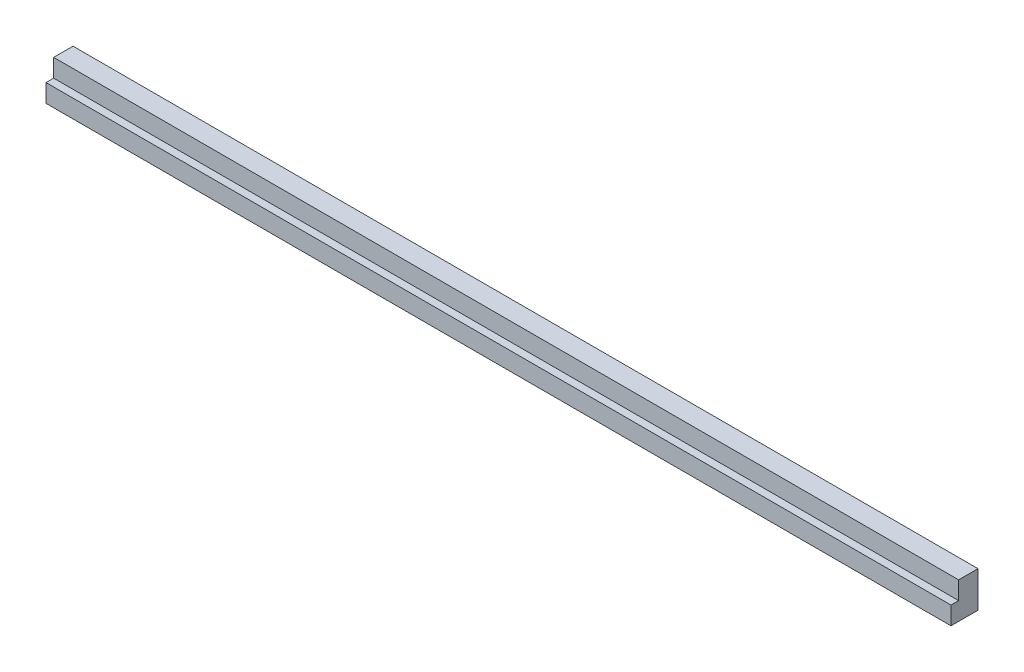
ISO-10303-21;
HEADER;
FILE_DESCRIPTION(('STEP AP214'),'2;1');
FILE_NAME('part.step','',(''),(''),'','','');
FILE_SCHEMA(('AUTOMOTIVE_DESIGN { 1 0 10303 214 1 1 1 1 }'));
ENDSEC;
DATA;
#1=APPLICATION_CONTEXT('core data for automotive mechanical design processes');
#2=APPLICATION_PROTOCOL_DEFINITION('international standard','automotive_design',2000,#1);
#3=PRODUCT_CONTEXT('',#1,'mechanical');
#4=PRODUCT('Part','Part','',(#3));
#5=PRODUCT_RELATED_PRODUCT_CATEGORY('part','',(#4));
#6=PRODUCT_DEFINITION_FORMATION('','',#4);
#7=PRODUCT_DEFINITION_CONTEXT('part definition',#1,'design');
#8=PRODUCT_DEFINITION('design','',#6,#7);
#9=PRODUCT_DEFINITION_SHAPE('','',#8);
#10=(LENGTH_UNIT() NAMED_UNIT(*) SI_UNIT(.MILLI.,.METRE.));
#11=(NAMED_UNIT(*) PLANE_ANGLE_UNIT() SI_UNIT($,.RADIAN.));
#12=(NAMED_UNIT(*) SI_UNIT($,.STERADIAN.) SOLID_ANGLE_UNIT());
#13=UNCERTAINTY_MEASURE_WITH_UNIT(LENGTH_MEASURE(1.E-05),#10,'distance_accuracy_value','');
#14=(GEOMETRIC_REPRESENTATION_CONTEXT(3) GLOBAL_UNCERTAINTY_ASSIGNED_CONTEXT((#13)) GLOBAL_UNIT_ASSIGNED_CONTEXT((#10,
#11,#12)) REPRESENTATION_CONTEXT('',''));
#15=CARTESIAN_POINT('',(0.,0.,0.));
#16=DIRECTION('',(0.,0.,1.));
#17=DIRECTION('',(1.,0.,0.));
#18=AXIS2_PLACEMENT_3D('',#15,#16,#17);
#19=CARTESIAN_POINT('',(-259.,-1.68892677621102E-13,21.5000000000004));
#20=DIRECTION('',(0.,0.,-1.));
#21=DIRECTION('',(0.,1.,0.));
#22=AXIS2_PLACEMENT_3D('',#19,#20,#21);
#23=PLANE('',#22);
#24=DIRECTION('',(-1.,0.,0.));
#25=VECTOR('',#24,1.);
#26=CARTESIAN_POINT('',(641.,-181.,21.5000000000003));
#27=LINE('',#26,#25);
#28=CARTESIAN_POINT('',(641.,-181.,21.5000000000003));
#29=VERTEX_POINT('',#28);
#30=CARTESIAN_POINT('',(-364.,-181.,21.5000000000003));
#31=VERTEX_POINT('',#30);
#32=EDGE_CURVE('E50',#29,#31,#27,.T.);
#33=ORIENTED_EDGE('',*,*,#32,.F.);
#34=DIRECTION('',(0.,-1.,0.));
#35=VECTOR('',#34,1.);
#36=CARTESIAN_POINT('',(641.,-201.,21.5000000000003));
#37=LINE('',#36,#35);
#38=CARTESIAN_POINT('',(641.,-161.,21.5000000000003));
#39=VERTEX_POINT('',#38);
#40=EDGE_CURVE('E42',#39,#29,#37,.T.);
#41=ORIENTED_EDGE('',*,*,#40,.F.);
#42=DIRECTION('',(1.,0.,0.));
#43=VECTOR('',#42,1.);
#44=CARTESIAN_POINT('',(-364.,-161.,21.5000000000003));
#45=LINE('',#44,#43);
#46=CARTESIAN_POINT('',(-364.,-161.,21.5000000000003));
#47=VERTEX_POINT('',#46);
#48=EDGE_CURVE('E37',#47,#39,#45,.T.);
#49=ORIENTED_EDGE('',*,*,#48,.F.);
#50=DIRECTION('',(0.,1.,0.));
#51=VECTOR('',#50,1.);
#52=CARTESIAN_POINT('',(-364.,-201.,21.5000000000003));
#53=LINE('',#52,#51);
#54=EDGE_CURVE('E11',#31,#47,#53,.T.);
#55=ORIENTED_EDGE('',*,*,#54,.F.);
#56=EDGE_LOOP('',(#33,#41,#49,#55));
#57=FACE_BOUND('',#56,.T.);
#58=ADVANCED_FACE('F33',(#57),#23,.F.);
#59=CARTESIAN_POINT('',(0.,0.,0.));
#60=DIRECTION('',(0.,0.,-1.));
#61=DIRECTION('',(-1.,0.,0.));
#62=AXIS2_PLACEMENT_3D('',#59,#60,#61);
#63=PLANE('',#62);
#64=DIRECTION('',(0.,-1.,0.));
#65=VECTOR('',#64,1.);
#66=CARTESIAN_POINT('',(-364.,-201.,0.));
#67=LINE('',#66,#65);
#68=CARTESIAN_POINT('',(-364.,-161.,0.));
#69=VERTEX_POINT('',#68);
#70=CARTESIAN_POINT('',(-364.,-201.,0.));
#71=VERTEX_POINT('',#70);
#72=EDGE_CURVE('E107',#69,#71,#67,.T.);
#73=ORIENTED_EDGE('',*,*,#72,.F.);
#74=DIRECTION('',(-1.,0.,0.));
#75=VECTOR('',#74,1.);
#76=CARTESIAN_POINT('',(-364.,-161.,0.));
#77=LINE('',#76,#75);
#78=CARTESIAN_POINT('',(641.,-161.,0.));
#79=VERTEX_POINT('',#78);
#80=EDGE_CURVE('E116',#79,#69,#77,.T.);
#81=ORIENTED_EDGE('',*,*,#80,.F.);
#82=DIRECTION('',(0.,1.,0.));
#83=VECTOR('',#82,1.);
#84=CARTESIAN_POINT('',(641.,-201.,0.));
#85=LINE('',#84,#83);
#86=CARTESIAN_POINT('',(641.,-201.,0.));
#87=VERTEX_POINT('',#86);
#88=EDGE_CURVE('E113',#87,#79,#85,.T.);
#89=ORIENTED_EDGE('',*,*,#88,.F.);
#90=DIRECTION('',(1.,0.,0.));
#91=VECTOR('',#90,1.);
#92=CARTESIAN_POINT('',(-364.,-201.,0.));
#93=LINE('',#92,#91);
#94=EDGE_CURVE('E110',#71,#87,#93,.T.);
#95=ORIENTED_EDGE('',*,*,#94,.F.);
#96=EDGE_LOOP('',(#73,#81,#89,#95));
#97=FACE_BOUND('',#96,.T.);
#98=ADVANCED_FACE('F133',(#97),#63,.T.);
#99=CARTESIAN_POINT('',(-364.,-161.,1027.29570490234));
#100=DIRECTION('',(0.,-1.,0.));
#101=DIRECTION('',(0.,0.,-1.));
#102=AXIS2_PLACEMENT_3D('',#99,#100,#101);
#103=PLANE('',#102);
#104=DIRECTION('',(0.,0.,-1.));
#105=VECTOR('',#104,1.);
#106=CARTESIAN_POINT('',(-364.,-161.,1027.29570490234));
#107=LINE('',#106,#105);
#108=EDGE_CURVE('E119',#47,#69,#107,.T.);
#109=ORIENTED_EDGE('',*,*,#108,.F.);
#110=ORIENTED_EDGE('',*,*,#48,.T.);
#111=DIRECTION('',(0.,0.,-1.));
#112=VECTOR('',#111,1.);
#113=CARTESIAN_POINT('',(641.,-161.,1027.29570490234));
#114=LINE('',#113,#112);
#115=EDGE_CURVE('E121',#39,#79,#114,.T.);
#116=ORIENTED_EDGE('',*,*,#115,.T.);
#117=ORIENTED_EDGE('',*,*,#80,.T.);
#118=EDGE_LOOP('',(#109,#110,#116,#117));
#119=FACE_BOUND('',#118,.T.);
#120=ADVANCED_FACE('F128',(#119),#103,.F.);
#121=CARTESIAN_POINT('',(641.,-201.,1027.29570490234));
#122=DIRECTION('',(-1.,0.,0.));
#123=DIRECTION('',(0.,0.,1.));
#124=AXIS2_PLACEMENT_3D('',#121,#122,#123);
#125=PLANE('',#124);
#126=ORIENTED_EDGE('',*,*,#115,.F.);
#127=ORIENTED_EDGE('',*,*,#40,.T.);
#128=DIRECTION('',(0.,0.,-1.));
#129=VECTOR('',#128,1.);
#130=CARTESIAN_POINT('',(641.,-181.,1035.19898527605));
#131=LINE('',#130,#129);
#132=CARTESIAN_POINT('',(641.,-181.,30.0000000000002));
#133=VERTEX_POINT('',#132);
#134=EDGE_CURVE('E92',#133,#29,#131,.T.);
#135=ORIENTED_EDGE('',*,*,#134,.F.);
#136=DIRECTION('',(0.,-1.,0.));
#137=VECTOR('',#136,1.);
#138=CARTESIAN_POINT('',(641.,-201.,30.0000000000002));
#139=LINE('',#138,#137);
#140=CARTESIAN_POINT('',(641.,-201.,30.0000000000002));
#141=VERTEX_POINT('',#140);
#142=EDGE_CURVE('E99',#133,#141,#139,.T.);
#143=ORIENTED_EDGE('',*,*,#142,.T.);
#144=DIRECTION('',(0.,0.,-1.));
#145=VECTOR('',#144,1.);
#146=CARTESIAN_POINT('',(641.,-201.,1027.29570490234));
#147=LINE('',#146,#145);
#148=EDGE_CURVE('E123',#141,#87,#147,.T.);
#149=ORIENTED_EDGE('',*,*,#148,.T.);
#150=ORIENTED_EDGE('',*,*,#88,.T.);
#151=EDGE_LOOP('',(#126,#127,#135,#143,#149,#150));
#152=FACE_BOUND('',#151,.T.);
#153=ADVANCED_FACE('F141',(#152),#125,.F.);
#154=CARTESIAN_POINT('',(-364.,-201.,1027.29570490234));
#155=DIRECTION('',(0.,1.,0.));
#156=DIRECTION('',(0.,0.,1.));
#157=AXIS2_PLACEMENT_3D('',#154,#155,#156);
#158=PLANE('',#157);
#159=ORIENTED_EDGE('',*,*,#148,.F.);
#160=DIRECTION('',(-1.,0.,0.));
#161=VECTOR('',#160,1.);
#162=CARTESIAN_POINT('',(640.999999999999,-201.,30.0000000000002));
#163=LINE('',#162,#161);
#164=CARTESIAN_POINT('',(-364.,-201.,30.0000000000002));
#165=VERTEX_POINT('',#164);
#166=EDGE_CURVE('E103',#141,#165,#163,.T.);
#167=ORIENTED_EDGE('',*,*,#166,.T.);
#168=DIRECTION('',(0.,0.,-1.));
#169=VECTOR('',#168,1.);
#170=CARTESIAN_POINT('',(-364.,-201.,1027.29570490234));
#171=LINE('',#170,#169);
#172=EDGE_CURVE('E124',#165,#71,#171,.T.);
#173=ORIENTED_EDGE('',*,*,#172,.T.);
#174=ORIENTED_EDGE('',*,*,#94,.T.);
#175=EDGE_LOOP('',(#159,#167,#173,#174));
#176=FACE_BOUND('',#175,.T.);
#177=ADVANCED_FACE('F135',(#176),#158,.F.);
#178=CARTESIAN_POINT('',(-364.,-201.,1027.29570490234));
#179=DIRECTION('',(1.,0.,0.));
#180=DIRECTION('',(0.,0.,-1.));
#181=AXIS2_PLACEMENT_3D('',#178,#179,#180);
#182=PLANE('',#181);
#183=ORIENTED_EDGE('',*,*,#172,.F.);
#184=DIRECTION('',(0.,1.,0.));
#185=VECTOR('',#184,1.);
#186=CARTESIAN_POINT('',(-364.,-201.,30.0000000000002));
#187=LINE('',#186,#185);
#188=CARTESIAN_POINT('',(-364.,-181.,30.0000000000002));
#189=VERTEX_POINT('',#188);
#190=EDGE_CURVE('E89',#165,#189,#187,.T.);
#191=ORIENTED_EDGE('',*,*,#190,.T.);
#192=DIRECTION('',(0.,0.,-1.));
#193=VECTOR('',#192,1.);
#194=CARTESIAN_POINT('',(-364.,-181.,1035.19898527605));
#195=LINE('',#194,#193);
#196=EDGE_CURVE('E87',#189,#31,#195,.T.);
#197=ORIENTED_EDGE('',*,*,#196,.T.);
#198=ORIENTED_EDGE('',*,*,#54,.T.);
#199=ORIENTED_EDGE('',*,*,#108,.T.);
#200=ORIENTED_EDGE('',*,*,#72,.T.);
#201=EDGE_LOOP('',(#183,#191,#197,#198,#199,#200));
#202=FACE_BOUND('',#201,.T.);
#203=ADVANCED_FACE('F35',(#202),#182,.F.);
#204=CARTESIAN_POINT('',(641.,-181.,1035.19898527605));
#205=DIRECTION('',(0.,-1.,0.));
#206=DIRECTION('',(0.,0.,-1.));
#207=AXIS2_PLACEMENT_3D('',#204,#205,#206);
#208=PLANE('',#207);
#209=ORIENTED_EDGE('',*,*,#196,.F.);
#210=DIRECTION('',(1.,0.,0.));
#211=VECTOR('',#210,1.);
#212=CARTESIAN_POINT('',(640.999999999999,-181.,30.0000000000002));
#213=LINE('',#212,#211);
#214=EDGE_CURVE('E142',#189,#133,#213,.T.);
#215=ORIENTED_EDGE('',*,*,#214,.T.);
#216=ORIENTED_EDGE('',*,*,#134,.T.);
#217=ORIENTED_EDGE('',*,*,#32,.T.);
#218=EDGE_LOOP('',(#209,#215,#216,#217));
#219=FACE_BOUND('',#218,.T.);
#220=ADVANCED_FACE('F95',(#219),#208,.F.);
#221=CARTESIAN_POINT('',(-259.,-1.66533453693773E-13,30.0000000000004));
#222=DIRECTION('',(0.,0.,-1.));
#223=DIRECTION('',(0.,1.,0.));
#224=AXIS2_PLACEMENT_3D('',#221,#222,#223);
#225=PLANE('',#224);
#226=ORIENTED_EDGE('',*,*,#214,.F.);
#227=ORIENTED_EDGE('',*,*,#190,.F.);
#228=ORIENTED_EDGE('',*,*,#166,.F.);
#229=ORIENTED_EDGE('',*,*,#142,.F.);
#230=EDGE_LOOP('',(#226,#227,#228,#229));
#231=FACE_BOUND('',#230,.T.);
#232=ADVANCED_FACE('F140',(#231),#225,.F.);
#233=CLOSED_SHELL('',(#58,#98,#120,#153,#177,#203,#220,#232));
#234=MANIFOLD_SOLID_BREP('B2',#233);
#235=ADVANCED_BREP_SHAPE_REPRESENTATION('',(#18,#234),#14);
#236=SHAPE_DEFINITION_REPRESENTATION(#9,#235);
ENDSEC;
END-ISO-10303-21;
